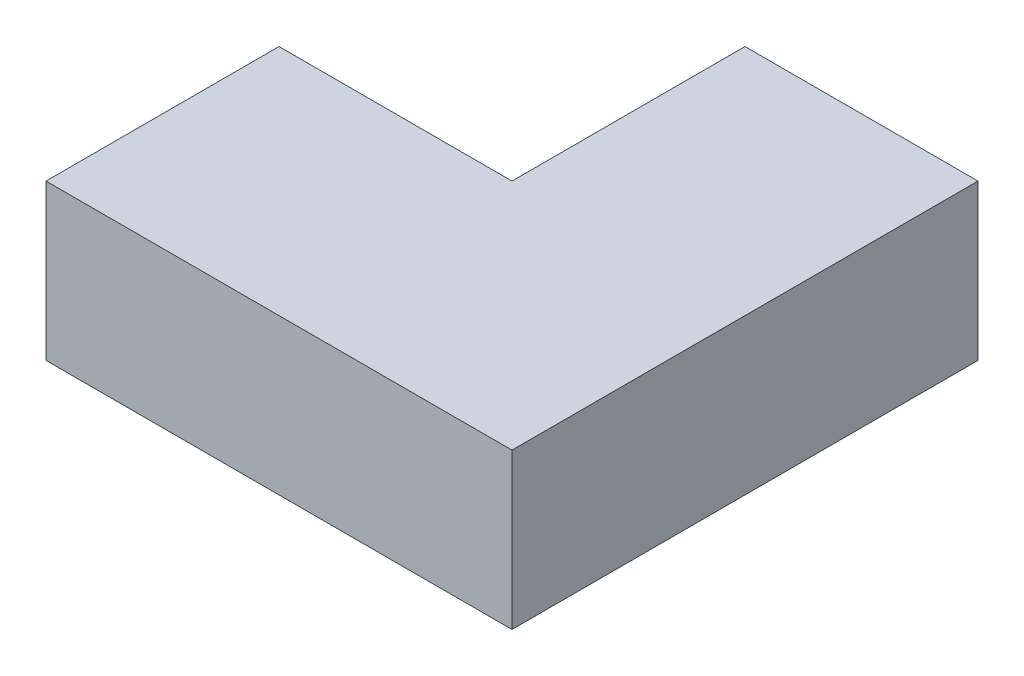
ISO-10303-21;
HEADER;
FILE_DESCRIPTION(('STEP AP214'),'2;1');
FILE_NAME('part.step','',(''),(''),'','','');
FILE_SCHEMA(('AUTOMOTIVE_DESIGN { 1 0 10303 214 1 1 1 1 }'));
ENDSEC;
DATA;
#1=APPLICATION_CONTEXT('core data for automotive mechanical design processes');
#2=APPLICATION_PROTOCOL_DEFINITION('international standard','automotive_design',2000,#1);
#3=PRODUCT_CONTEXT('',#1,'mechanical');
#4=PRODUCT('Part','Part','',(#3));
#5=PRODUCT_RELATED_PRODUCT_CATEGORY('part','',(#4));
#6=PRODUCT_DEFINITION_FORMATION('','',#4);
#7=PRODUCT_DEFINITION_CONTEXT('part definition',#1,'design');
#8=PRODUCT_DEFINITION('design','',#6,#7);
#9=PRODUCT_DEFINITION_SHAPE('','',#8);
#10=(LENGTH_UNIT() NAMED_UNIT(*) SI_UNIT(.MILLI.,.METRE.));
#11=(NAMED_UNIT(*) PLANE_ANGLE_UNIT() SI_UNIT($,.RADIAN.));
#12=(NAMED_UNIT(*) SI_UNIT($,.STERADIAN.) SOLID_ANGLE_UNIT());
#13=UNCERTAINTY_MEASURE_WITH_UNIT(LENGTH_MEASURE(1.E-05),#10,'distance_accuracy_value','');
#14=(GEOMETRIC_REPRESENTATION_CONTEXT(3) GLOBAL_UNCERTAINTY_ASSIGNED_CONTEXT((#13)) GLOBAL_UNIT_ASSIGNED_CONTEXT((#10,
#11,#12)) REPRESENTATION_CONTEXT('',''));
#15=CARTESIAN_POINT('',(0.,0.,0.));
#16=DIRECTION('',(0.,0.,1.));
#17=DIRECTION('',(1.,0.,0.));
#18=AXIS2_PLACEMENT_3D('',#15,#16,#17);
#19=CARTESIAN_POINT('',(0.,0.2,0.));
#20=DIRECTION('',(0.,1.,0.));
#21=DIRECTION('',(1.,0.,0.));
#22=AXIS2_PLACEMENT_3D('',#19,#20,#21);
#23=PLANE('',#22);
#24=DIRECTION('',(0.,0.,-1.));
#25=VECTOR('',#24,1.);
#26=CARTESIAN_POINT('',(-1.2,0.2,-1.2));
#27=LINE('',#26,#25);
#28=CARTESIAN_POINT('',(-1.2,0.2,-1.2));
#29=VERTEX_POINT('',#28);
#30=CARTESIAN_POINT('',(-1.2,0.2,-1.5));
#31=VERTEX_POINT('',#30);
#32=EDGE_CURVE('E11',#29,#31,#27,.T.);
#33=ORIENTED_EDGE('',*,*,#32,.T.);
#34=DIRECTION('',(-1.,0.,0.));
#35=VECTOR('',#34,1.);
#36=CARTESIAN_POINT('',(-1.2,0.2,-1.5));
#37=LINE('',#36,#35);
#38=CARTESIAN_POINT('',(-1.35,0.2,-1.5));
#39=VERTEX_POINT('',#38);
#40=EDGE_CURVE('E24',#31,#39,#37,.T.);
#41=ORIENTED_EDGE('',*,*,#40,.T.);
#42=DIRECTION('',(0.,0.,1.));
#43=VECTOR('',#42,1.);
#44=CARTESIAN_POINT('',(-1.35,0.2,-1.5));
#45=LINE('',#44,#43);
#46=CARTESIAN_POINT('',(-1.35,0.2,-1.35));
#47=VERTEX_POINT('',#46);
#48=EDGE_CURVE('E116',#39,#47,#45,.T.);
#49=ORIENTED_EDGE('',*,*,#48,.T.);
#50=DIRECTION('',(-1.,0.,0.));
#51=VECTOR('',#50,1.);
#52=CARTESIAN_POINT('',(-1.35,0.2,-1.35));
#53=LINE('',#52,#51);
#54=CARTESIAN_POINT('',(-1.5,0.2,-1.35));
#55=VERTEX_POINT('',#54);
#56=EDGE_CURVE('E114',#47,#55,#53,.T.);
#57=ORIENTED_EDGE('',*,*,#56,.T.);
#58=DIRECTION('',(0.,0.,1.));
#59=VECTOR('',#58,1.);
#60=CARTESIAN_POINT('',(-1.5,0.2,-1.35));
#61=LINE('',#60,#59);
#62=CARTESIAN_POINT('',(-1.5,0.2,-1.2));
#63=VERTEX_POINT('',#62);
#64=EDGE_CURVE('E74',#55,#63,#61,.T.);
#65=ORIENTED_EDGE('',*,*,#64,.T.);
#66=DIRECTION('',(1.,0.,0.));
#67=VECTOR('',#66,1.);
#68=CARTESIAN_POINT('',(-1.5,0.2,-1.2));
#69=LINE('',#68,#67);
#70=EDGE_CURVE('E36',#63,#29,#69,.T.);
#71=ORIENTED_EDGE('',*,*,#70,.T.);
#72=EDGE_LOOP('',(#33,#41,#49,#57,#65,#71));
#73=FACE_BOUND('',#72,.T.);
#74=ADVANCED_FACE('F17',(#73),#23,.T.);
#75=CARTESIAN_POINT('',(-1.5,0.2,-1.2));
#76=DIRECTION('',(0.,0.,1.));
#77=DIRECTION('',(1.,0.,0.));
#78=AXIS2_PLACEMENT_3D('',#75,#76,#77);
#79=PLANE('',#78);
#80=DIRECTION('',(0.,-1.,0.));
#81=VECTOR('',#80,1.);
#82=CARTESIAN_POINT('',(-1.5,0.2,-1.2));
#83=LINE('',#82,#81);
#84=CARTESIAN_POINT('',(-1.5,0.1,-1.2));
#85=VERTEX_POINT('',#84);
#86=EDGE_CURVE('E110',#63,#85,#83,.T.);
#87=ORIENTED_EDGE('',*,*,#86,.T.);
#88=DIRECTION('',(1.,0.,0.));
#89=VECTOR('',#88,1.);
#90=CARTESIAN_POINT('',(-1.5,0.1,-1.2));
#91=LINE('',#90,#89);
#92=CARTESIAN_POINT('',(-1.2,0.1,-1.2));
#93=VERTEX_POINT('',#92);
#94=EDGE_CURVE('E90',#85,#93,#91,.T.);
#95=ORIENTED_EDGE('',*,*,#94,.T.);
#96=DIRECTION('',(0.,-1.,0.));
#97=VECTOR('',#96,1.);
#98=CARTESIAN_POINT('',(-1.2,0.2,-1.2));
#99=LINE('',#98,#97);
#100=EDGE_CURVE('E107',#29,#93,#99,.T.);
#101=ORIENTED_EDGE('',*,*,#100,.F.);
#102=ORIENTED_EDGE('',*,*,#70,.F.);
#103=EDGE_LOOP('',(#87,#95,#101,#102));
#104=FACE_BOUND('',#103,.T.);
#105=ADVANCED_FACE('F127',(#104),#79,.T.);
#106=CARTESIAN_POINT('',(-1.2,0.2,-1.2));
#107=DIRECTION('',(1.,0.,0.));
#108=DIRECTION('',(0.,0.,-1.));
#109=AXIS2_PLACEMENT_3D('',#106,#107,#108);
#110=PLANE('',#109);
#111=ORIENTED_EDGE('',*,*,#100,.T.);
#112=DIRECTION('',(0.,0.,-1.));
#113=VECTOR('',#112,1.);
#114=CARTESIAN_POINT('',(-1.2,0.1,-1.2));
#115=LINE('',#114,#113);
#116=CARTESIAN_POINT('',(-1.2,0.1,-1.5));
#117=VERTEX_POINT('',#116);
#118=EDGE_CURVE('E104',#93,#117,#115,.T.);
#119=ORIENTED_EDGE('',*,*,#118,.T.);
#120=DIRECTION('',(0.,-1.,0.));
#121=VECTOR('',#120,1.);
#122=CARTESIAN_POINT('',(-1.2,0.2,-1.5));
#123=LINE('',#122,#121);
#124=EDGE_CURVE('E102',#31,#117,#123,.T.);
#125=ORIENTED_EDGE('',*,*,#124,.F.);
#126=ORIENTED_EDGE('',*,*,#32,.F.);
#127=EDGE_LOOP('',(#111,#119,#125,#126));
#128=FACE_BOUND('',#127,.T.);
#129=ADVANCED_FACE('F124',(#128),#110,.T.);
#130=CARTESIAN_POINT('',(-1.2,0.2,-1.5));
#131=DIRECTION('',(0.,0.,-1.));
#132=DIRECTION('',(-1.,0.,0.));
#133=AXIS2_PLACEMENT_3D('',#130,#131,#132);
#134=PLANE('',#133);
#135=ORIENTED_EDGE('',*,*,#124,.T.);
#136=DIRECTION('',(-1.,0.,0.));
#137=VECTOR('',#136,1.);
#138=CARTESIAN_POINT('',(-1.2,0.1,-1.5));
#139=LINE('',#138,#137);
#140=CARTESIAN_POINT('',(-1.35,0.1,-1.5));
#141=VERTEX_POINT('',#140);
#142=EDGE_CURVE('E99',#117,#141,#139,.T.);
#143=ORIENTED_EDGE('',*,*,#142,.T.);
#144=DIRECTION('',(0.,-1.,0.));
#145=VECTOR('',#144,1.);
#146=CARTESIAN_POINT('',(-1.35,0.2,-1.5));
#147=LINE('',#146,#145);
#148=EDGE_CURVE('E97',#39,#141,#147,.T.);
#149=ORIENTED_EDGE('',*,*,#148,.F.);
#150=ORIENTED_EDGE('',*,*,#40,.F.);
#151=EDGE_LOOP('',(#135,#143,#149,#150));
#152=FACE_BOUND('',#151,.T.);
#153=ADVANCED_FACE('F119',(#152),#134,.T.);
#154=CARTESIAN_POINT('',(-1.35,0.2,-1.5));
#155=DIRECTION('',(-1.,0.,0.));
#156=DIRECTION('',(0.,0.,1.));
#157=AXIS2_PLACEMENT_3D('',#154,#155,#156);
#158=PLANE('',#157);
#159=ORIENTED_EDGE('',*,*,#148,.T.);
#160=DIRECTION('',(0.,0.,1.));
#161=VECTOR('',#160,1.);
#162=CARTESIAN_POINT('',(-1.35,0.1,-1.5));
#163=LINE('',#162,#161);
#164=CARTESIAN_POINT('',(-1.35,0.1,-1.35));
#165=VERTEX_POINT('',#164);
#166=EDGE_CURVE('E95',#141,#165,#163,.T.);
#167=ORIENTED_EDGE('',*,*,#166,.T.);
#168=DIRECTION('',(0.,-1.,0.));
#169=VECTOR('',#168,1.);
#170=CARTESIAN_POINT('',(-1.35,0.2,-1.35));
#171=LINE('',#170,#169);
#172=EDGE_CURVE('E82',#47,#165,#171,.T.);
#173=ORIENTED_EDGE('',*,*,#172,.F.);
#174=ORIENTED_EDGE('',*,*,#48,.F.);
#175=EDGE_LOOP('',(#159,#167,#173,#174));
#176=FACE_BOUND('',#175,.T.);
#177=ADVANCED_FACE('F122',(#176),#158,.T.);
#178=CARTESIAN_POINT('',(-1.35,0.2,-1.35));
#179=DIRECTION('',(0.,0.,-1.));
#180=DIRECTION('',(-1.,0.,0.));
#181=AXIS2_PLACEMENT_3D('',#178,#179,#180);
#182=PLANE('',#181);
#183=ORIENTED_EDGE('',*,*,#172,.T.);
#184=DIRECTION('',(-1.,0.,0.));
#185=VECTOR('',#184,1.);
#186=CARTESIAN_POINT('',(-1.35,0.1,-1.35));
#187=LINE('',#186,#185);
#188=CARTESIAN_POINT('',(-1.5,0.1,-1.35));
#189=VERTEX_POINT('',#188);
#190=EDGE_CURVE('E77',#165,#189,#187,.T.);
#191=ORIENTED_EDGE('',*,*,#190,.T.);
#192=DIRECTION('',(0.,-1.,0.));
#193=VECTOR('',#192,1.);
#194=CARTESIAN_POINT('',(-1.5,0.2,-1.35));
#195=LINE('',#194,#193);
#196=EDGE_CURVE('E68',#55,#189,#195,.T.);
#197=ORIENTED_EDGE('',*,*,#196,.F.);
#198=ORIENTED_EDGE('',*,*,#56,.F.);
#199=EDGE_LOOP('',(#183,#191,#197,#198));
#200=FACE_BOUND('',#199,.T.);
#201=ADVANCED_FACE('F80',(#200),#182,.T.);
#202=CARTESIAN_POINT('',(-1.5,0.2,-1.35));
#203=DIRECTION('',(-1.,0.,0.));
#204=DIRECTION('',(0.,0.,1.));
#205=AXIS2_PLACEMENT_3D('',#202,#203,#204);
#206=PLANE('',#205);
#207=ORIENTED_EDGE('',*,*,#196,.T.);
#208=DIRECTION('',(0.,0.,1.));
#209=VECTOR('',#208,1.);
#210=CARTESIAN_POINT('',(-1.5,0.1,-1.35));
#211=LINE('',#210,#209);
#212=EDGE_CURVE('E73',#189,#85,#211,.T.);
#213=ORIENTED_EDGE('',*,*,#212,.T.);
#214=ORIENTED_EDGE('',*,*,#86,.F.);
#215=ORIENTED_EDGE('',*,*,#64,.F.);
#216=EDGE_LOOP('',(#207,#213,#214,#215));
#217=FACE_BOUND('',#216,.T.);
#218=ADVANCED_FACE('F70',(#217),#206,.T.);
#219=CARTESIAN_POINT('',(0.,0.1,0.));
#220=DIRECTION('',(0.,1.,0.));
#221=DIRECTION('',(1.,0.,0.));
#222=AXIS2_PLACEMENT_3D('',#219,#220,#221);
#223=PLANE('',#222);
#224=ORIENTED_EDGE('',*,*,#212,.F.);
#225=ORIENTED_EDGE('',*,*,#190,.F.);
#226=ORIENTED_EDGE('',*,*,#166,.F.);
#227=ORIENTED_EDGE('',*,*,#142,.F.);
#228=ORIENTED_EDGE('',*,*,#118,.F.);
#229=ORIENTED_EDGE('',*,*,#94,.F.);
#230=EDGE_LOOP('',(#224,#225,#226,#227,#228,#229));
#231=FACE_BOUND('',#230,.T.);
#232=ADVANCED_FACE('F87',(#231),#223,.F.);
#233=CLOSED_SHELL('',(#74,#105,#129,#153,#177,#201,#218,#232));
#234=MANIFOLD_SOLID_BREP('B1',#233);
#235=ADVANCED_BREP_SHAPE_REPRESENTATION('',(#18,#234),#14);
#236=SHAPE_DEFINITION_REPRESENTATION(#9,#235);
ENDSEC;
END-ISO-10303-21;
